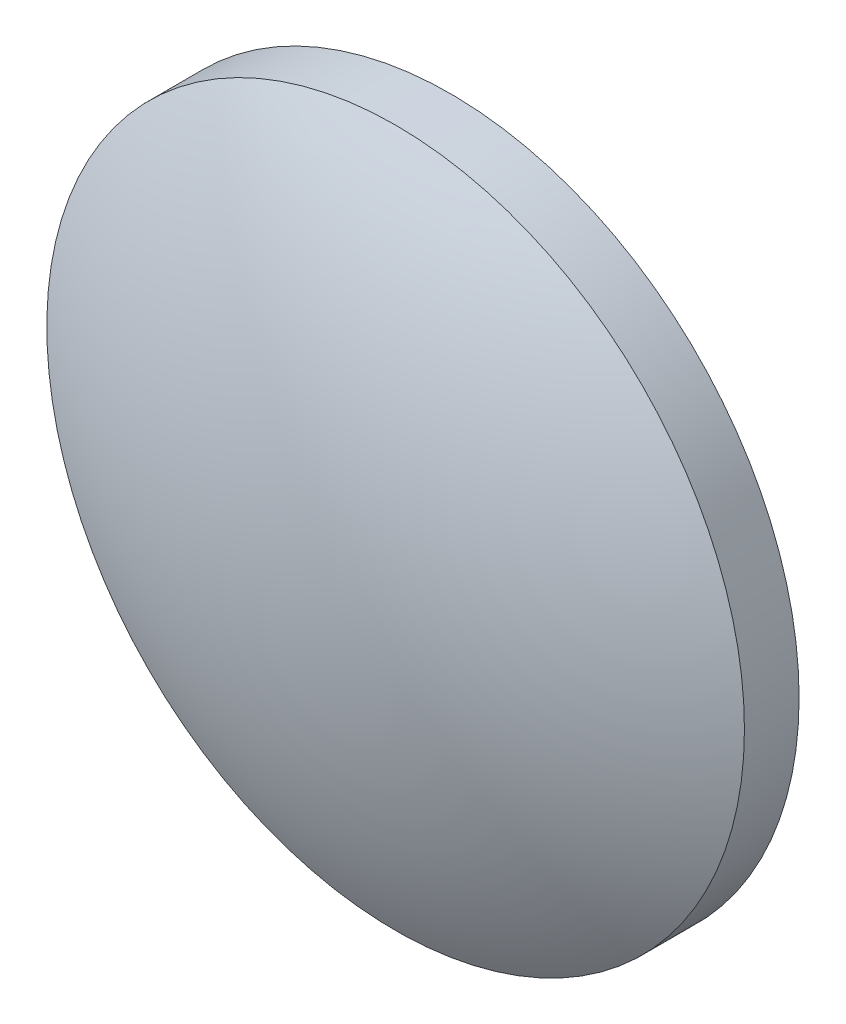
ISO-10303-21;
HEADER;
FILE_DESCRIPTION(('STEP AP214'),'2;1');
FILE_NAME('part.step','',(''),(''),'','','');
FILE_SCHEMA(('AUTOMOTIVE_DESIGN { 1 0 10303 214 1 1 1 1 }'));
ENDSEC;
DATA;
#1=APPLICATION_CONTEXT('core data for automotive mechanical design processes');
#2=APPLICATION_PROTOCOL_DEFINITION('international standard','automotive_design',2000,#1);
#3=PRODUCT_CONTEXT('',#1,'mechanical');
#4=PRODUCT('Part','Part','',(#3));
#5=PRODUCT_RELATED_PRODUCT_CATEGORY('part','',(#4));
#6=PRODUCT_DEFINITION_FORMATION('','',#4);
#7=PRODUCT_DEFINITION_CONTEXT('part definition',#1,'design');
#8=PRODUCT_DEFINITION('design','',#6,#7);
#9=PRODUCT_DEFINITION_SHAPE('','',#8);
#10=(LENGTH_UNIT() NAMED_UNIT(*) SI_UNIT(.MILLI.,.METRE.));
#11=(NAMED_UNIT(*) PLANE_ANGLE_UNIT() SI_UNIT($,.RADIAN.));
#12=(NAMED_UNIT(*) SI_UNIT($,.STERADIAN.) SOLID_ANGLE_UNIT());
#13=UNCERTAINTY_MEASURE_WITH_UNIT(LENGTH_MEASURE(1.E-05),#10,'distance_accuracy_value','');
#14=(GEOMETRIC_REPRESENTATION_CONTEXT(3) GLOBAL_UNCERTAINTY_ASSIGNED_CONTEXT((#13)) GLOBAL_UNIT_ASSIGNED_CONTEXT((#10,
#11,#12)) REPRESENTATION_CONTEXT('',''));
#15=CARTESIAN_POINT('',(0.,0.,0.));
#16=DIRECTION('',(0.,0.,1.));
#17=DIRECTION('',(1.,0.,0.));
#18=AXIS2_PLACEMENT_3D('',#15,#16,#17);
#19=CARTESIAN_POINT('',(0.,0.,-23.08));
#20=DIRECTION('',(0.,0.,1.));
#21=DIRECTION('',(0.,1.,0.));
#22=AXIS2_PLACEMENT_3D('',#19,#20,#21);
#23=SPHERICAL_SURFACE('',#22,25.75);
#24=CARTESIAN_POINT('',(0.,0.,-0.679720983880581));
#25=DIRECTION('',(0.,0.,1.));
#26=DIRECTION('',(1.,0.,0.));
#27=AXIS2_PLACEMENT_3D('',#24,#25,#26);
#28=CIRCLE('',#27,12.7);
#29=CARTESIAN_POINT('',(12.7,0.,-0.679720983880581));
#30=VERTEX_POINT('',#29);
#31=EDGE_CURVE('E8',#30,#30,#28,.T.);
#32=ORIENTED_EDGE('',*,*,#31,.T.);
#33=EDGE_LOOP('',(#32));
#34=FACE_BOUND('',#33,.T.);
#35=ADVANCED_FACE('F12',(#34),#23,.T.);
#36=CARTESIAN_POINT('',(0.,0.,4.30813204540037));
#37=DIRECTION('',(0.,0.,1.));
#38=DIRECTION('',(1.,0.,0.));
#39=AXIS2_PLACEMENT_3D('',#36,#37,#38);
#40=CYLINDRICAL_SURFACE('',#39,12.7);
#41=ORIENTED_EDGE('',*,*,#31,.F.);
#42=EDGE_LOOP('',(#41));
#43=FACE_BOUND('',#42,.T.);
#44=CARTESIAN_POINT('',(0.,0.,-2.67));
#45=DIRECTION('',(0.,0.,1.));
#46=DIRECTION('',(1.,0.,0.));
#47=AXIS2_PLACEMENT_3D('',#44,#45,#46);
#48=CIRCLE('',#47,12.7);
#49=CARTESIAN_POINT('',(12.7,0.,-2.67));
#50=VERTEX_POINT('',#49);
#51=EDGE_CURVE('E18',#50,#50,#48,.T.);
#52=ORIENTED_EDGE('',*,*,#51,.T.);
#53=EDGE_LOOP('',(#52));
#54=FACE_BOUND('',#53,.T.);
#55=ADVANCED_FACE('F24',(#43,#54),#40,.T.);
#56=CARTESIAN_POINT('',(0.,0.,-2.67));
#57=DIRECTION('',(0.,0.,1.));
#58=DIRECTION('',(1.,0.,0.));
#59=AXIS2_PLACEMENT_3D('',#56,#57,#58);
#60=PLANE('',#59);
#61=ORIENTED_EDGE('',*,*,#51,.F.);
#62=EDGE_LOOP('',(#61));
#63=FACE_BOUND('',#62,.T.);
#64=ADVANCED_FACE('F26',(#63),#60,.F.);
#65=CLOSED_SHELL('',(#35,#55,#64));
#66=MANIFOLD_SOLID_BREP('B1',#65);
#67=ADVANCED_BREP_SHAPE_REPRESENTATION('',(#18,#66),#14);
#68=SHAPE_DEFINITION_REPRESENTATION(#9,#67);
ENDSEC;
END-ISO-10303-21;
